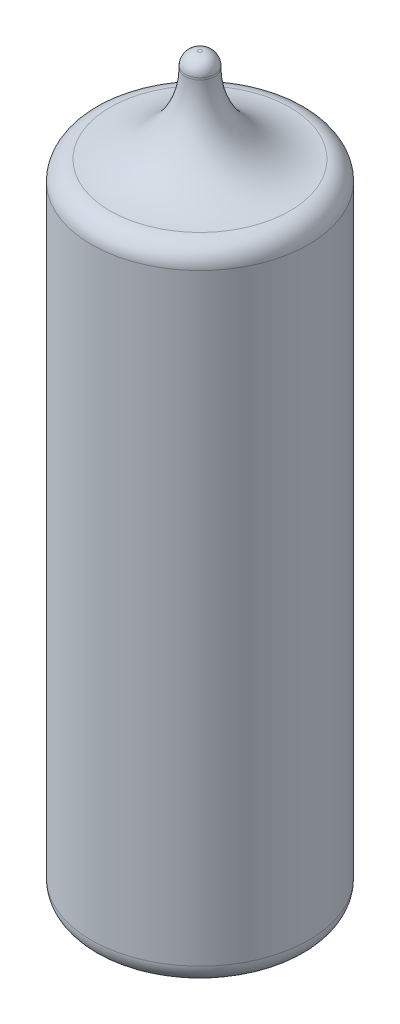
ISO-10303-21;
HEADER;
FILE_DESCRIPTION(('STEP AP214'),'2;1');
FILE_NAME('part.step','',(''),(''),'','','');
FILE_SCHEMA(('AUTOMOTIVE_DESIGN { 1 0 10303 214 1 1 1 1 }'));
ENDSEC;
DATA;
#1=APPLICATION_CONTEXT('core data for automotive mechanical design processes');
#2=APPLICATION_PROTOCOL_DEFINITION('international standard','automotive_design',2000,#1);
#3=PRODUCT_CONTEXT('',#1,'mechanical');
#4=PRODUCT('Part','Part','',(#3));
#5=PRODUCT_RELATED_PRODUCT_CATEGORY('part','',(#4));
#6=PRODUCT_DEFINITION_FORMATION('','',#4);
#7=PRODUCT_DEFINITION_CONTEXT('part definition',#1,'design');
#8=PRODUCT_DEFINITION('design','',#6,#7);
#9=PRODUCT_DEFINITION_SHAPE('','',#8);
#10=(LENGTH_UNIT() NAMED_UNIT(*) SI_UNIT(.MILLI.,.METRE.));
#11=(NAMED_UNIT(*) PLANE_ANGLE_UNIT() SI_UNIT($,.RADIAN.));
#12=(NAMED_UNIT(*) SI_UNIT($,.STERADIAN.) SOLID_ANGLE_UNIT());
#13=UNCERTAINTY_MEASURE_WITH_UNIT(LENGTH_MEASURE(1.E-05),#10,'distance_accuracy_value','');
#14=(GEOMETRIC_REPRESENTATION_CONTEXT(3) GLOBAL_UNCERTAINTY_ASSIGNED_CONTEXT((#13)) GLOBAL_UNIT_ASSIGNED_CONTEXT((#10,
#11,#12)) REPRESENTATION_CONTEXT('',''));
#15=CARTESIAN_POINT('',(0.,0.,0.));
#16=DIRECTION('',(0.,0.,1.));
#17=DIRECTION('',(1.,0.,0.));
#18=AXIS2_PLACEMENT_3D('',#15,#16,#17);
#19=CARTESIAN_POINT('',(0.,65.,0.));
#20=DIRECTION('',(0.,-1.,0.));
#21=DIRECTION('',(0.,0.,-1.));
#22=AXIS2_PLACEMENT_3D('',#19,#20,#21);
#23=CYLINDRICAL_SURFACE('',#22,11.);
#24=CARTESIAN_POINT('',(0.,2.,0.));
#25=DIRECTION('',(0.,1.,0.));
#26=DIRECTION('',(0.,0.,1.));
#27=AXIS2_PLACEMENT_3D('',#24,#25,#26);
#28=CIRCLE('',#27,11.);
#29=CARTESIAN_POINT('',(0.,2.,11.));
#30=VERTEX_POINT('',#29);
#31=EDGE_CURVE('E40',#30,#30,#28,.T.);
#32=ORIENTED_EDGE('',*,*,#31,.T.);
#33=EDGE_LOOP('',(#32));
#34=FACE_BOUND('',#33,.T.);
#35=CARTESIAN_POINT('',(0.,63.0125078222809,0.));
#36=DIRECTION('',(0.,-1.,0.));
#37=DIRECTION('',(0.,0.,-1.));
#38=AXIS2_PLACEMENT_3D('',#35,#36,#37);
#39=CIRCLE('',#38,11.);
#40=CARTESIAN_POINT('',(0.,63.0125078222809,-11.));
#41=VERTEX_POINT('',#40);
#42=EDGE_CURVE('E44',#41,#41,#39,.T.);
#43=ORIENTED_EDGE('',*,*,#42,.T.);
#44=EDGE_LOOP('',(#43));
#45=FACE_BOUND('',#44,.T.);
#46=ADVANCED_FACE('F33',(#34,#45),#23,.T.);
#47=CARTESIAN_POINT('',(0.,0.,0.));
#48=DIRECTION('',(0.,1.,0.));
#49=DIRECTION('',(0.,0.,1.));
#50=AXIS2_PLACEMENT_3D('',#47,#48,#49);
#51=PLANE('',#50);
#52=CARTESIAN_POINT('',(0.,0.,0.));
#53=DIRECTION('',(0.,1.,0.));
#54=DIRECTION('',(0.,0.,1.));
#55=AXIS2_PLACEMENT_3D('',#52,#53,#54);
#56=CIRCLE('',#55,9.);
#57=CARTESIAN_POINT('',(0.,0.,9.));
#58=VERTEX_POINT('',#57);
#59=EDGE_CURVE('E10',#58,#58,#56,.F.);
#60=ORIENTED_EDGE('',*,*,#59,.T.);
#61=EDGE_LOOP('',(#60));
#62=FACE_BOUND('',#61,.T.);
#63=ADVANCED_FACE('F82',(#62),#51,.F.);
#64=CARTESIAN_POINT('',(0.,74.5,0.));
#65=DIRECTION('',(0.,-1.,0.));
#66=DIRECTION('',(0.,0.,-1.));
#67=AXIS2_PLACEMENT_3D('',#64,#65,#66);
#68=CYLINDRICAL_SURFACE('',#67,1.5);
#69=CARTESIAN_POINT('',(0.,73.,0.));
#70=DIRECTION('',(0.,1.,0.));
#71=DIRECTION('',(0.,0.,1.));
#72=AXIS2_PLACEMENT_3D('',#69,#70,#71);
#73=CIRCLE('',#72,1.5);
#74=CARTESIAN_POINT('',(0.,73.,1.5));
#75=VERTEX_POINT('',#74);
#76=EDGE_CURVE('E53',#75,#75,#73,.T.);
#77=ORIENTED_EDGE('',*,*,#76,.T.);
#78=EDGE_LOOP('',(#77));
#79=FACE_BOUND('',#78,.T.);
#80=CARTESIAN_POINT('',(0.,73.2,0.));
#81=DIRECTION('',(0.,1.,0.));
#82=DIRECTION('',(0.,0.,1.));
#83=AXIS2_PLACEMENT_3D('',#80,#81,#82);
#84=CIRCLE('',#83,1.5);
#85=CARTESIAN_POINT('',(0.,73.2,1.5));
#86=VERTEX_POINT('',#85);
#87=EDGE_CURVE('E56',#86,#86,#84,.F.);
#88=ORIENTED_EDGE('',*,*,#87,.T.);
#89=EDGE_LOOP('',(#88));
#90=FACE_BOUND('',#89,.T.);
#91=ADVANCED_FACE('F77',(#79,#90),#68,.T.);
#92=CARTESIAN_POINT('',(0.,74.5,0.));
#93=DIRECTION('',(0.,1.,0.));
#94=DIRECTION('',(0.,0.,1.));
#95=AXIS2_PLACEMENT_3D('',#92,#93,#94);
#96=PLANE('',#95);
#97=CARTESIAN_POINT('',(0.,74.5,0.));
#98=DIRECTION('',(0.,1.,0.));
#99=DIRECTION('',(0.,0.,1.));
#100=AXIS2_PLACEMENT_3D('',#97,#98,#99);
#101=CIRCLE('',#100,0.2);
#102=CARTESIAN_POINT('',(0.,74.5,0.2));
#103=VERTEX_POINT('',#102);
#104=EDGE_CURVE('E59',#103,#103,#101,.T.);
#105=ORIENTED_EDGE('',*,*,#104,.T.);
#106=EDGE_LOOP('',(#105));
#107=FACE_BOUND('',#106,.T.);
#108=ADVANCED_FACE('F63',(#107),#96,.T.);
#109=CARTESIAN_POINT('',(0.,73.2,0.));
#110=DIRECTION('',(0.,1.,0.));
#111=DIRECTION('',(0.,0.,1.));
#112=AXIS2_PLACEMENT_3D('',#109,#110,#111);
#113=DEGENERATE_TOROIDAL_SURFACE('',#112,0.2,1.3,.T.);
#114=ORIENTED_EDGE('',*,*,#87,.F.);
#115=EDGE_LOOP('',(#114));
#116=FACE_BOUND('',#115,.T.);
#117=ORIENTED_EDGE('',*,*,#104,.F.);
#118=EDGE_LOOP('',(#117));
#119=FACE_BOUND('',#118,.T.);
#120=ADVANCED_FACE('F65',(#116,#119),#113,.T.);
#121=CARTESIAN_POINT('',(0.,73.,0.));
#122=DIRECTION('',(0.,1.,0.));
#123=DIRECTION('',(0.,0.,1.));
#124=AXIS2_PLACEMENT_3D('',#121,#122,#123);
#125=TOROIDAL_SURFACE('',#124,9.5,8.);
#126=CARTESIAN_POINT('',(0.,65.0100062578238,0.));
#127=DIRECTION('',(0.,1.,0.));
#128=DIRECTION('',(0.,0.,1.));
#129=AXIS2_PLACEMENT_3D('',#126,#127,#128);
#130=CIRCLE('',#129,9.09999999999995);
#131=CARTESIAN_POINT('',(0.,65.0100062578238,9.09999999999995));
#132=VERTEX_POINT('',#131);
#133=EDGE_CURVE('E48',#132,#132,#130,.T.);
#134=ORIENTED_EDGE('',*,*,#133,.T.);
#135=EDGE_LOOP('',(#134));
#136=FACE_BOUND('',#135,.T.);
#137=ORIENTED_EDGE('',*,*,#76,.F.);
#138=EDGE_LOOP('',(#137));
#139=FACE_BOUND('',#138,.T.);
#140=ADVANCED_FACE('F67',(#136,#139),#125,.F.);
#141=CARTESIAN_POINT('',(0.,63.0125078222809,0.));
#142=DIRECTION('',(0.,-1.,0.));
#143=DIRECTION('',(0.,0.,-1.));
#144=AXIS2_PLACEMENT_3D('',#141,#142,#143);
#145=TOROIDAL_SURFACE('',#144,9.,2.);
#146=ORIENTED_EDGE('',*,*,#42,.F.);
#147=EDGE_LOOP('',(#146));
#148=FACE_BOUND('',#147,.T.);
#149=ORIENTED_EDGE('',*,*,#133,.F.);
#150=EDGE_LOOP('',(#149));
#151=FACE_BOUND('',#150,.T.);
#152=ADVANCED_FACE('F74',(#148,#151),#145,.T.);
#153=CARTESIAN_POINT('',(0.,2.,0.));
#154=DIRECTION('',(0.,1.,0.));
#155=DIRECTION('',(0.,0.,1.));
#156=AXIS2_PLACEMENT_3D('',#153,#154,#155);
#157=TOROIDAL_SURFACE('',#156,9.,2.);
#158=ORIENTED_EDGE('',*,*,#59,.F.);
#159=EDGE_LOOP('',(#158));
#160=FACE_BOUND('',#159,.T.);
#161=ORIENTED_EDGE('',*,*,#31,.F.);
#162=EDGE_LOOP('',(#161));
#163=FACE_BOUND('',#162,.T.);
#164=ADVANCED_FACE('F35',(#160,#163),#157,.T.);
#165=CLOSED_SHELL('',(#46,#63,#91,#108,#120,#140,#152,#164));
#166=MANIFOLD_SOLID_BREP('B2',#165);
#167=ADVANCED_BREP_SHAPE_REPRESENTATION('',(#18,#166),#14);
#168=SHAPE_DEFINITION_REPRESENTATION(#9,#167);
ENDSEC;
END-ISO-10303-21;
